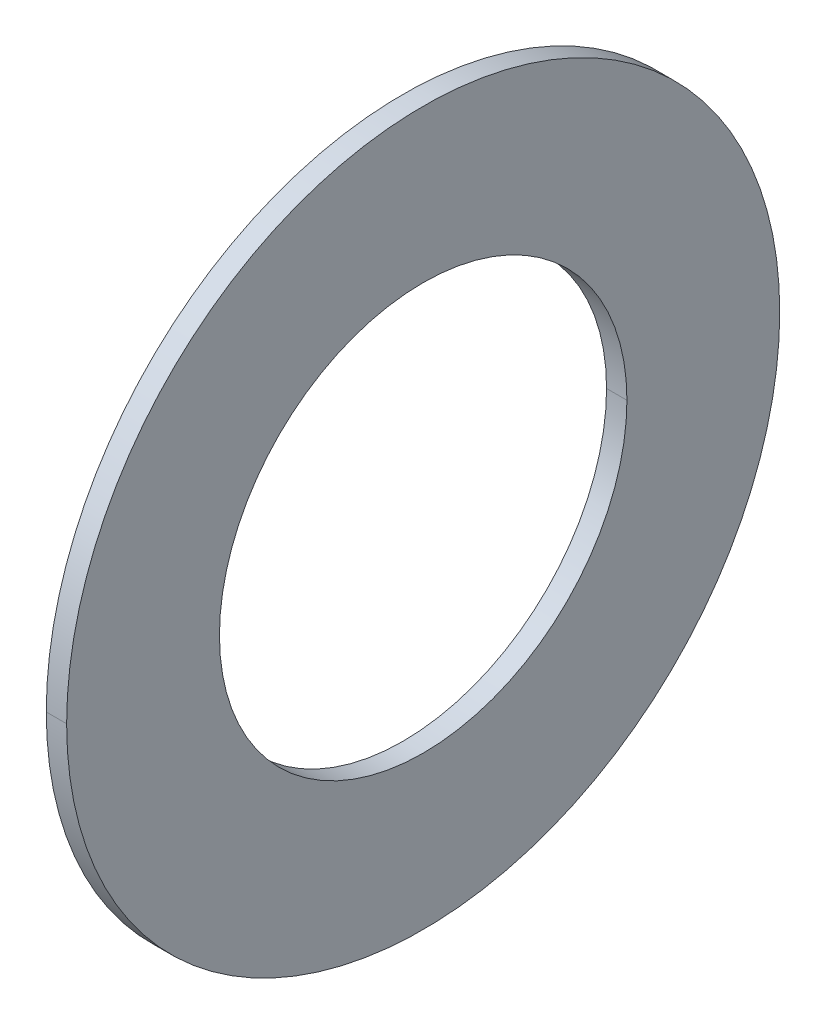
ISO-10303-21;
HEADER;
FILE_DESCRIPTION(('STEP AP214'),'2;1');
FILE_NAME('part.step','',(''),(''),'','','');
FILE_SCHEMA(('AUTOMOTIVE_DESIGN { 1 0 10303 214 1 1 1 1 }'));
ENDSEC;
DATA;
#1=APPLICATION_CONTEXT('core data for automotive mechanical design processes');
#2=APPLICATION_PROTOCOL_DEFINITION('international standard','automotive_design',2000,#1);
#3=PRODUCT_CONTEXT('',#1,'mechanical');
#4=PRODUCT('Part','Part','',(#3));
#5=PRODUCT_RELATED_PRODUCT_CATEGORY('part','',(#4));
#6=PRODUCT_DEFINITION_FORMATION('','',#4);
#7=PRODUCT_DEFINITION_CONTEXT('part definition',#1,'design');
#8=PRODUCT_DEFINITION('design','',#6,#7);
#9=PRODUCT_DEFINITION_SHAPE('','',#8);
#10=(LENGTH_UNIT() NAMED_UNIT(*) SI_UNIT(.MILLI.,.METRE.));
#11=(NAMED_UNIT(*) PLANE_ANGLE_UNIT() SI_UNIT($,.RADIAN.));
#12=(NAMED_UNIT(*) SI_UNIT($,.STERADIAN.) SOLID_ANGLE_UNIT());
#13=UNCERTAINTY_MEASURE_WITH_UNIT(LENGTH_MEASURE(1.E-05),#10,'distance_accuracy_value','');
#14=(GEOMETRIC_REPRESENTATION_CONTEXT(3) GLOBAL_UNCERTAINTY_ASSIGNED_CONTEXT((#13)) GLOBAL_UNIT_ASSIGNED_CONTEXT((#10,
#11,#12)) REPRESENTATION_CONTEXT('',''));
#15=CARTESIAN_POINT('',(0.,0.,0.));
#16=DIRECTION('',(0.,0.,1.));
#17=DIRECTION('',(1.,0.,0.));
#18=AXIS2_PLACEMENT_3D('',#15,#16,#17);
#19=CARTESIAN_POINT('',(-2.,17.5,0.));
#20=DIRECTION('',(-1.,0.,0.));
#21=DIRECTION('',(0.,0.,1.));
#22=AXIS2_PLACEMENT_3D('',#19,#20,#21);
#23=PLANE('',#22);
#24=CARTESIAN_POINT('',(-2.,0.,0.));
#25=DIRECTION('',(1.,0.,0.));
#26=DIRECTION('',(0.,0.,-1.));
#27=AXIS2_PLACEMENT_3D('',#24,#25,#26);
#28=CIRCLE('',#27,10.);
#29=CARTESIAN_POINT('',(-2.,0.,-10.));
#30=VERTEX_POINT('',#29);
#31=CARTESIAN_POINT('',(-2.,0.,10.));
#32=VERTEX_POINT('',#31);
#33=EDGE_CURVE('E11',#30,#32,#28,.T.);
#34=ORIENTED_EDGE('',*,*,#33,.T.);
#35=CARTESIAN_POINT('',(-2.,0.,0.));
#36=DIRECTION('',(1.,0.,0.));
#37=DIRECTION('',(0.,0.,-1.));
#38=AXIS2_PLACEMENT_3D('',#35,#36,#37);
#39=CIRCLE('',#38,10.);
#40=EDGE_CURVE('E25',#32,#30,#39,.T.);
#41=ORIENTED_EDGE('',*,*,#40,.T.);
#42=EDGE_LOOP('',(#34,#41));
#43=FACE_BOUND('',#42,.T.);
#44=CARTESIAN_POINT('',(-2.,0.,0.));
#45=DIRECTION('',(1.,0.,0.));
#46=DIRECTION('',(0.,0.,-1.));
#47=AXIS2_PLACEMENT_3D('',#44,#45,#46);
#48=CIRCLE('',#47,17.5);
#49=CARTESIAN_POINT('',(-2.,0.,17.5));
#50=VERTEX_POINT('',#49);
#51=CARTESIAN_POINT('',(-2.,0.,-17.5));
#52=VERTEX_POINT('',#51);
#53=EDGE_CURVE('E95',#50,#52,#48,.T.);
#54=ORIENTED_EDGE('',*,*,#53,.F.);
#55=CARTESIAN_POINT('',(-2.,0.,0.));
#56=DIRECTION('',(1.,0.,0.));
#57=DIRECTION('',(0.,0.,-1.));
#58=AXIS2_PLACEMENT_3D('',#55,#56,#57);
#59=CIRCLE('',#58,17.5);
#60=EDGE_CURVE('E90',#52,#50,#59,.T.);
#61=ORIENTED_EDGE('',*,*,#60,.F.);
#62=EDGE_LOOP('',(#54,#61));
#63=FACE_BOUND('',#62,.T.);
#64=ADVANCED_FACE('F17',(#43,#63),#23,.T.);
#65=CARTESIAN_POINT('',(50.,0.,0.));
#66=DIRECTION('',(1.,0.,0.));
#67=DIRECTION('',(0.,-1.,0.));
#68=AXIS2_PLACEMENT_3D('',#65,#66,#67);
#69=CYLINDRICAL_SURFACE('',#68,17.5);
#70=DIRECTION('',(1.,0.,0.));
#71=VECTOR('',#70,1.);
#72=CARTESIAN_POINT('',(-2.,0.,17.5));
#73=LINE('',#72,#71);
#74=CARTESIAN_POINT('',(-1.,0.,17.5));
#75=VERTEX_POINT('',#74);
#76=EDGE_CURVE('E86',#50,#75,#73,.T.);
#77=ORIENTED_EDGE('',*,*,#76,.T.);
#78=CARTESIAN_POINT('',(-1.,0.,0.));
#79=DIRECTION('',(1.,0.,0.));
#80=DIRECTION('',(0.,0.,-1.));
#81=AXIS2_PLACEMENT_3D('',#78,#79,#80);
#82=CIRCLE('',#81,17.5);
#83=CARTESIAN_POINT('',(-1.,0.,-17.5));
#84=VERTEX_POINT('',#83);
#85=EDGE_CURVE('E81',#84,#75,#82,.T.);
#86=ORIENTED_EDGE('',*,*,#85,.F.);
#87=DIRECTION('',(1.,0.,0.));
#88=VECTOR('',#87,1.);
#89=CARTESIAN_POINT('',(-2.,0.,-17.5));
#90=LINE('',#89,#88);
#91=EDGE_CURVE('E70',#52,#84,#90,.T.);
#92=ORIENTED_EDGE('',*,*,#91,.F.);
#93=ORIENTED_EDGE('',*,*,#60,.T.);
#94=EDGE_LOOP('',(#77,#86,#92,#93));
#95=FACE_BOUND('',#94,.T.);
#96=ADVANCED_FACE('F111',(#95),#69,.T.);
#97=CARTESIAN_POINT('',(50.,0.,0.));
#98=DIRECTION('',(1.,0.,0.));
#99=DIRECTION('',(0.,1.,0.));
#100=AXIS2_PLACEMENT_3D('',#97,#98,#99);
#101=CYLINDRICAL_SURFACE('',#100,17.5);
#102=ORIENTED_EDGE('',*,*,#76,.F.);
#103=ORIENTED_EDGE('',*,*,#53,.T.);
#104=ORIENTED_EDGE('',*,*,#91,.T.);
#105=CARTESIAN_POINT('',(-1.,0.,0.));
#106=DIRECTION('',(1.,0.,0.));
#107=DIRECTION('',(0.,0.,-1.));
#108=AXIS2_PLACEMENT_3D('',#105,#106,#107);
#109=CIRCLE('',#108,17.5);
#110=EDGE_CURVE('E67',#75,#84,#109,.T.);
#111=ORIENTED_EDGE('',*,*,#110,.F.);
#112=EDGE_LOOP('',(#102,#103,#104,#111));
#113=FACE_BOUND('',#112,.T.);
#114=ADVANCED_FACE('F106',(#113),#101,.T.);
#115=CARTESIAN_POINT('',(-1.,10.,0.));
#116=DIRECTION('',(1.,0.,0.));
#117=DIRECTION('',(0.,0.,-1.));
#118=AXIS2_PLACEMENT_3D('',#115,#116,#117);
#119=PLANE('',#118);
#120=ORIENTED_EDGE('',*,*,#85,.T.);
#121=ORIENTED_EDGE('',*,*,#110,.T.);
#122=EDGE_LOOP('',(#120,#121));
#123=FACE_BOUND('',#122,.T.);
#124=CARTESIAN_POINT('',(-1.,0.,0.));
#125=DIRECTION('',(1.,0.,0.));
#126=DIRECTION('',(0.,0.,-1.));
#127=AXIS2_PLACEMENT_3D('',#124,#125,#126);
#128=CIRCLE('',#127,10.);
#129=CARTESIAN_POINT('',(-1.,0.,10.));
#130=VERTEX_POINT('',#129);
#131=CARTESIAN_POINT('',(-1.,0.,-10.));
#132=VERTEX_POINT('',#131);
#133=EDGE_CURVE('E55',#130,#132,#128,.T.);
#134=ORIENTED_EDGE('',*,*,#133,.F.);
#135=CARTESIAN_POINT('',(-1.,0.,0.));
#136=DIRECTION('',(1.,0.,0.));
#137=DIRECTION('',(0.,0.,-1.));
#138=AXIS2_PLACEMENT_3D('',#135,#136,#137);
#139=CIRCLE('',#138,10.);
#140=EDGE_CURVE('E51',#132,#130,#139,.T.);
#141=ORIENTED_EDGE('',*,*,#140,.F.);
#142=EDGE_LOOP('',(#134,#141));
#143=FACE_BOUND('',#142,.T.);
#144=ADVANCED_FACE('F53',(#123,#143),#119,.T.);
#145=CARTESIAN_POINT('',(50.,0.,0.));
#146=DIRECTION('',(1.,0.,0.));
#147=DIRECTION('',(0.,-1.,0.));
#148=AXIS2_PLACEMENT_3D('',#145,#146,#147);
#149=CYLINDRICAL_SURFACE('',#148,10.);
#150=DIRECTION('',(1.,0.,0.));
#151=VECTOR('',#150,1.);
#152=CARTESIAN_POINT('',(-2.,0.,10.));
#153=LINE('',#152,#151);
#154=EDGE_CURVE('E59',#32,#130,#153,.T.);
#155=ORIENTED_EDGE('',*,*,#154,.F.);
#156=ORIENTED_EDGE('',*,*,#33,.F.);
#157=DIRECTION('',(1.,0.,0.));
#158=VECTOR('',#157,1.);
#159=CARTESIAN_POINT('',(-2.,0.,-10.));
#160=LINE('',#159,#158);
#161=EDGE_CURVE('E62',#30,#132,#160,.T.);
#162=ORIENTED_EDGE('',*,*,#161,.T.);
#163=ORIENTED_EDGE('',*,*,#140,.T.);
#164=EDGE_LOOP('',(#155,#156,#162,#163));
#165=FACE_BOUND('',#164,.T.);
#166=ADVANCED_FACE('F63',(#165),#149,.F.);
#167=CARTESIAN_POINT('',(50.,0.,0.));
#168=DIRECTION('',(1.,0.,0.));
#169=DIRECTION('',(0.,1.,0.));
#170=AXIS2_PLACEMENT_3D('',#167,#168,#169);
#171=CYLINDRICAL_SURFACE('',#170,10.);
#172=ORIENTED_EDGE('',*,*,#154,.T.);
#173=ORIENTED_EDGE('',*,*,#133,.T.);
#174=ORIENTED_EDGE('',*,*,#161,.F.);
#175=ORIENTED_EDGE('',*,*,#40,.F.);
#176=EDGE_LOOP('',(#172,#173,#174,#175));
#177=FACE_BOUND('',#176,.T.);
#178=ADVANCED_FACE('F66',(#177),#171,.F.);
#179=CLOSED_SHELL('',(#64,#96,#114,#144,#166,#178));
#180=MANIFOLD_SOLID_BREP('B1',#179);
#181=ADVANCED_BREP_SHAPE_REPRESENTATION('',(#18,#180),#14);
#182=SHAPE_DEFINITION_REPRESENTATION(#9,#181);
ENDSEC;
END-ISO-10303-21;
